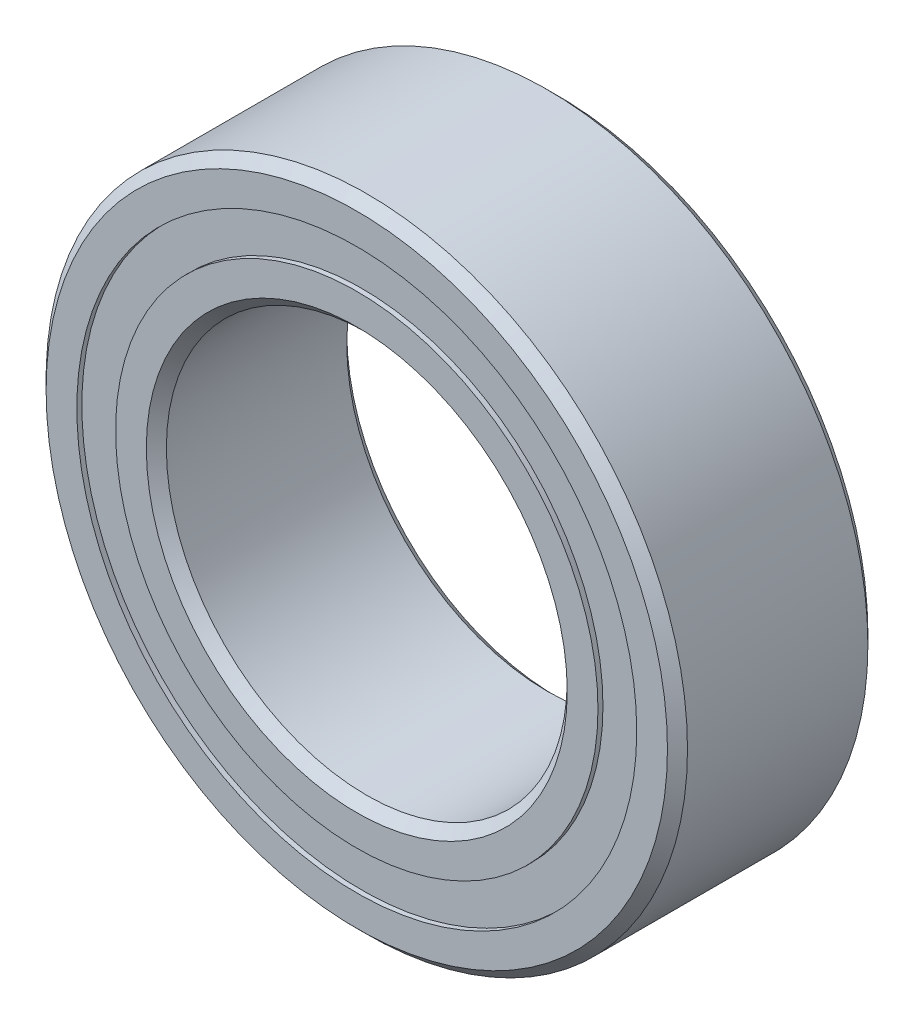
ISO-10303-21;
HEADER;
FILE_DESCRIPTION(('STEP AP214'),'2;1');
FILE_NAME('part.step','',(''),(''),'','','');
FILE_SCHEMA(('AUTOMOTIVE_DESIGN { 1 0 10303 214 1 1 1 1 }'));
ENDSEC;
DATA;
#1=APPLICATION_CONTEXT('core data for automotive mechanical design processes');
#2=APPLICATION_PROTOCOL_DEFINITION('international standard','automotive_design',2000,#1);
#3=PRODUCT_CONTEXT('',#1,'mechanical');
#4=PRODUCT('Part','Part','',(#3));
#5=PRODUCT_RELATED_PRODUCT_CATEGORY('part','',(#4));
#6=PRODUCT_DEFINITION_FORMATION('','',#4);
#7=PRODUCT_DEFINITION_CONTEXT('part definition',#1,'design');
#8=PRODUCT_DEFINITION('design','',#6,#7);
#9=PRODUCT_DEFINITION_SHAPE('','',#8);
#10=(LENGTH_UNIT() NAMED_UNIT(*) SI_UNIT(.MILLI.,.METRE.));
#11=(NAMED_UNIT(*) PLANE_ANGLE_UNIT() SI_UNIT($,.RADIAN.));
#12=(NAMED_UNIT(*) SI_UNIT($,.STERADIAN.) SOLID_ANGLE_UNIT());
#13=UNCERTAINTY_MEASURE_WITH_UNIT(LENGTH_MEASURE(1.E-05),#10,'distance_accuracy_value','');
#14=(GEOMETRIC_REPRESENTATION_CONTEXT(3) GLOBAL_UNCERTAINTY_ASSIGNED_CONTEXT((#13)) GLOBAL_UNIT_ASSIGNED_CONTEXT((#10,
#11,#12)) REPRESENTATION_CONTEXT('',''));
#15=CARTESIAN_POINT('',(0.,0.,0.));
#16=DIRECTION('',(0.,0.,1.));
#17=DIRECTION('',(1.,0.,0.));
#18=AXIS2_PLACEMENT_3D('',#15,#16,#17);
#19=CARTESIAN_POINT('',(0.,3.49175824175824,-1.1875));
#20=DIRECTION('',(0.,0.,1.));
#21=DIRECTION('',(1.,0.,0.));
#22=AXIS2_PLACEMENT_3D('',#19,#20,#21);
#23=PLANE('',#22);
#24=CARTESIAN_POINT('',(0.,0.,-1.1875));
#25=DIRECTION('',(0.,0.,1.));
#26=DIRECTION('',(1.,0.,0.));
#27=AXIS2_PLACEMENT_3D('',#24,#25,#26);
#28=CIRCLE('',#27,3.49175824175824);
#29=CARTESIAN_POINT('',(3.49175824175824,0.,-1.1875));
#30=VERTEX_POINT('',#29);
#31=EDGE_CURVE('E70',#30,#30,#28,.T.);
#32=ORIENTED_EDGE('',*,*,#31,.F.);
#33=EDGE_LOOP('',(#32));
#34=FACE_BOUND('',#33,.T.);
#35=CARTESIAN_POINT('',(0.,0.,-1.1875));
#36=DIRECTION('',(0.,0.,1.));
#37=DIRECTION('',(1.,0.,0.));
#38=AXIS2_PLACEMENT_3D('',#35,#36,#37);
#39=CIRCLE('',#38,3.00824175824176);
#40=CARTESIAN_POINT('',(3.00824175824176,0.,-1.1875));
#41=VERTEX_POINT('',#40);
#42=EDGE_CURVE('E11',#41,#41,#39,.T.);
#43=ORIENTED_EDGE('',*,*,#42,.T.);
#44=EDGE_LOOP('',(#43));
#45=FACE_BOUND('',#44,.T.);
#46=ADVANCED_FACE('F56',(#34,#45),#23,.F.);
#47=CARTESIAN_POINT('',(0.,0.,1.25));
#48=DIRECTION('',(0.,0.,1.));
#49=DIRECTION('',(1.,0.,0.));
#50=AXIS2_PLACEMENT_3D('',#47,#48,#49);
#51=CYLINDRICAL_SURFACE('',#50,3.00824175824176);
#52=ORIENTED_EDGE('',*,*,#42,.F.);
#53=EDGE_LOOP('',(#52));
#54=FACE_BOUND('',#53,.T.);
#55=CARTESIAN_POINT('',(0.,0.,-0.605878719519575));
#56=DIRECTION('',(0.,0.,1.));
#57=DIRECTION('',(1.,0.,0.));
#58=AXIS2_PLACEMENT_3D('',#55,#56,#57);
#59=CIRCLE('',#58,3.00824175824176);
#60=CARTESIAN_POINT('',(3.00824175824176,0.,-0.605878719519575));
#61=VERTEX_POINT('',#60);
#62=EDGE_CURVE('E62',#61,#61,#59,.T.);
#63=ORIENTED_EDGE('',*,*,#62,.T.);
#64=EDGE_LOOP('',(#63));
#65=FACE_BOUND('',#64,.T.);
#66=ADVANCED_FACE('F79',(#54,#65),#51,.F.);
#67=CARTESIAN_POINT('',(0.,3.49175824175824,-0.605878719519575));
#68=DIRECTION('',(0.,0.,-1.));
#69=DIRECTION('',(-1.,0.,0.));
#70=AXIS2_PLACEMENT_3D('',#67,#68,#69);
#71=PLANE('',#70);
#72=ORIENTED_EDGE('',*,*,#62,.F.);
#73=EDGE_LOOP('',(#72));
#74=FACE_BOUND('',#73,.T.);
#75=CARTESIAN_POINT('',(0.,0.,-0.605878719519575));
#76=DIRECTION('',(0.,0.,1.));
#77=DIRECTION('',(1.,0.,0.));
#78=AXIS2_PLACEMENT_3D('',#75,#76,#77);
#79=CIRCLE('',#78,3.49175824175824);
#80=CARTESIAN_POINT('',(3.49175824175824,0.,-0.605878719519575));
#81=VERTEX_POINT('',#80);
#82=EDGE_CURVE('E66',#81,#81,#79,.T.);
#83=ORIENTED_EDGE('',*,*,#82,.T.);
#84=EDGE_LOOP('',(#83));
#85=FACE_BOUND('',#84,.T.);
#86=ADVANCED_FACE('F83',(#74,#85),#71,.F.);
#87=CARTESIAN_POINT('',(0.,0.,1.25));
#88=DIRECTION('',(0.,0.,1.));
#89=DIRECTION('',(1.,0.,0.));
#90=AXIS2_PLACEMENT_3D('',#87,#88,#89);
#91=CYLINDRICAL_SURFACE('',#90,3.49175824175824);
#92=ORIENTED_EDGE('',*,*,#82,.F.);
#93=EDGE_LOOP('',(#92));
#94=FACE_BOUND('',#93,.T.);
#95=ORIENTED_EDGE('',*,*,#31,.T.);
#96=EDGE_LOOP('',(#95));
#97=FACE_BOUND('',#96,.T.);
#98=ADVANCED_FACE('F76',(#94,#97),#91,.T.);
#99=CLOSED_SHELL('',(#46,#66,#86,#98));
#100=MANIFOLD_SOLID_BREP('B2',#99);
#101=CARTESIAN_POINT('',(0.,3.49175824175824,1.1875));
#102=DIRECTION('',(0.,0.,-1.));
#103=DIRECTION('',(-1.,0.,0.));
#104=AXIS2_PLACEMENT_3D('',#101,#102,#103);
#105=PLANE('',#104);
#106=CARTESIAN_POINT('',(0.,0.,1.1875));
#107=DIRECTION('',(0.,0.,1.));
#108=DIRECTION('',(1.,0.,0.));
#109=AXIS2_PLACEMENT_3D('',#106,#107,#108);
#110=CIRCLE('',#109,3.00824175824176);
#111=CARTESIAN_POINT('',(3.00824175824176,0.,1.1875));
#112=VERTEX_POINT('',#111);
#113=EDGE_CURVE('E55',#112,#112,#110,.T.);
#114=ORIENTED_EDGE('',*,*,#113,.F.);
#115=EDGE_LOOP('',(#114));
#116=FACE_BOUND('',#115,.T.);
#117=CARTESIAN_POINT('',(0.,0.,1.1875));
#118=DIRECTION('',(0.,0.,1.));
#119=DIRECTION('',(1.,0.,0.));
#120=AXIS2_PLACEMENT_3D('',#117,#118,#119);
#121=CIRCLE('',#120,3.49175824175824);
#122=CARTESIAN_POINT('',(3.49175824175824,0.,1.1875));
#123=VERTEX_POINT('',#122);
#124=EDGE_CURVE('E130',#123,#123,#121,.T.);
#125=ORIENTED_EDGE('',*,*,#124,.T.);
#126=EDGE_LOOP('',(#125));
#127=FACE_BOUND('',#126,.T.);
#128=ADVANCED_FACE('F116',(#116,#127),#105,.F.);
#129=CARTESIAN_POINT('',(0.,0.,1.25));
#130=DIRECTION('',(0.,0.,1.));
#131=DIRECTION('',(1.,0.,0.));
#132=AXIS2_PLACEMENT_3D('',#129,#130,#131);
#133=CYLINDRICAL_SURFACE('',#132,3.00824175824176);
#134=CARTESIAN_POINT('',(0.,0.,0.605878719519573));
#135=DIRECTION('',(0.,0.,1.));
#136=DIRECTION('',(1.,0.,0.));
#137=AXIS2_PLACEMENT_3D('',#134,#135,#136);
#138=CIRCLE('',#137,3.00824175824176);
#139=CARTESIAN_POINT('',(3.00824175824176,0.,0.605878719519573));
#140=VERTEX_POINT('',#139);
#141=EDGE_CURVE('E122',#140,#140,#138,.T.);
#142=ORIENTED_EDGE('',*,*,#141,.F.);
#143=EDGE_LOOP('',(#142));
#144=FACE_BOUND('',#143,.T.);
#145=ORIENTED_EDGE('',*,*,#113,.T.);
#146=EDGE_LOOP('',(#145));
#147=FACE_BOUND('',#146,.T.);
#148=ADVANCED_FACE('F145',(#144,#147),#133,.F.);
#149=CARTESIAN_POINT('',(0.,3.49175824175824,0.605878719519573));
#150=DIRECTION('',(0.,0.,1.));
#151=DIRECTION('',(1.,0.,0.));
#152=AXIS2_PLACEMENT_3D('',#149,#150,#151);
#153=PLANE('',#152);
#154=CARTESIAN_POINT('',(0.,0.,0.605878719519573));
#155=DIRECTION('',(0.,0.,1.));
#156=DIRECTION('',(1.,0.,0.));
#157=AXIS2_PLACEMENT_3D('',#154,#155,#156);
#158=CIRCLE('',#157,3.49175824175824);
#159=CARTESIAN_POINT('',(3.49175824175824,0.,0.605878719519573));
#160=VERTEX_POINT('',#159);
#161=EDGE_CURVE('E126',#160,#160,#158,.T.);
#162=ORIENTED_EDGE('',*,*,#161,.F.);
#163=EDGE_LOOP('',(#162));
#164=FACE_BOUND('',#163,.T.);
#165=ORIENTED_EDGE('',*,*,#141,.T.);
#166=EDGE_LOOP('',(#165));
#167=FACE_BOUND('',#166,.T.);
#168=ADVANCED_FACE('F140',(#164,#167),#153,.F.);
#169=CARTESIAN_POINT('',(0.,0.,1.25));
#170=DIRECTION('',(0.,0.,1.));
#171=DIRECTION('',(1.,0.,0.));
#172=AXIS2_PLACEMENT_3D('',#169,#170,#171);
#173=CYLINDRICAL_SURFACE('',#172,3.49175824175824);
#174=ORIENTED_EDGE('',*,*,#124,.F.);
#175=EDGE_LOOP('',(#174));
#176=FACE_BOUND('',#175,.T.);
#177=ORIENTED_EDGE('',*,*,#161,.T.);
#178=EDGE_LOOP('',(#177));
#179=FACE_BOUND('',#178,.T.);
#180=ADVANCED_FACE('F137',(#176,#179),#173,.T.);
#181=CLOSED_SHELL('',(#128,#148,#168,#180));
#182=MANIFOLD_SOLID_BREP('B6',#181);
#183=CARTESIAN_POINT('',(-1.62499999999996,2.81458256229945,0.));
#184=DIRECTION('',(0.,0.,1.));
#185=DIRECTION('',(-0.499999999999989,0.866025403784445,0.));
#186=AXIS2_PLACEMENT_3D('',#183,#184,#185);
#187=SPHERICAL_SURFACE('',#186,0.605878719519574);
#188=CARTESIAN_POINT('',(-1.62499999999996,2.81458256229945,0.605878719519573));
#189=VERTEX_POINT('',#188);
#190=VERTEX_LOOP('',#189);
#191=FACE_BOUND('',#190,.T.);
#192=ADVANCED_FACE('F176',(#191),#187,.T.);
#193=CLOSED_SHELL('',(#192));
#194=MANIFOLD_SOLID_BREP('B50',#193);
#195=CARTESIAN_POINT('',(-2.81458256229941,1.62500000000003,0.));
#196=DIRECTION('',(0.,0.,1.));
#197=DIRECTION('',(-0.866025403784433,0.50000000000001,0.));
#198=AXIS2_PLACEMENT_3D('',#195,#196,#197);
#199=SPHERICAL_SURFACE('',#198,0.605878719519574);
#200=CARTESIAN_POINT('',(-2.81458256229941,1.62500000000003,0.605878719519573));
#201=VERTEX_POINT('',#200);
#202=VERTEX_LOOP('',#201);
#203=FACE_BOUND('',#202,.T.);
#204=ADVANCED_FACE('F199',(#203),#199,.T.);
#205=CLOSED_SHELL('',(#204));
#206=MANIFOLD_SOLID_BREP('B112',#205);
#207=CARTESIAN_POINT('',(-3.25,0.,0.));
#208=DIRECTION('',(0.,0.,1.));
#209=DIRECTION('',(-1.,0.,0.));
#210=AXIS2_PLACEMENT_3D('',#207,#208,#209);
#211=SPHERICAL_SURFACE('',#210,0.605878719519574);
#212=CARTESIAN_POINT('',(-3.25,0.,0.605878719519573));
#213=VERTEX_POINT('',#212);
#214=VERTEX_LOOP('',#213);
#215=FACE_BOUND('',#214,.T.);
#216=ADVANCED_FACE('F222',(#215),#211,.T.);
#217=CLOSED_SHELL('',(#216));
#218=MANIFOLD_SOLID_BREP('B172',#217);
#219=CARTESIAN_POINT('',(-2.81458256229944,-1.62499999999997,0.));
#220=DIRECTION('',(0.,0.,1.));
#221=DIRECTION('',(-0.866025403784443,-0.499999999999992,0.));
#222=AXIS2_PLACEMENT_3D('',#219,#220,#221);
#223=SPHERICAL_SURFACE('',#222,0.605878719519574);
#224=CARTESIAN_POINT('',(-2.81458256229944,-1.62499999999997,0.605878719519573));
#225=VERTEX_POINT('',#224);
#226=VERTEX_LOOP('',#225);
#227=FACE_BOUND('',#226,.T.);
#228=ADVANCED_FACE('F245',(#227),#223,.T.);
#229=CLOSED_SHELL('',(#228));
#230=MANIFOLD_SOLID_BREP('B195',#229);
#231=CARTESIAN_POINT('',(-1.62500000000002,-2.81458256229941,0.));
#232=DIRECTION('',(0.,0.,1.));
#233=DIRECTION('',(-0.500000000000007,-0.866025403784435,0.));
#234=AXIS2_PLACEMENT_3D('',#231,#232,#233);
#235=SPHERICAL_SURFACE('',#234,0.605878719519574);
#236=CARTESIAN_POINT('',(-1.62500000000002,-2.81458256229941,0.605878719519573));
#237=VERTEX_POINT('',#236);
#238=VERTEX_LOOP('',#237);
#239=FACE_BOUND('',#238,.T.);
#240=ADVANCED_FACE('F268',(#239),#235,.T.);
#241=CLOSED_SHELL('',(#240));
#242=MANIFOLD_SOLID_BREP('B218',#241);
#243=CARTESIAN_POINT('',(0.,-3.25,0.));
#244=DIRECTION('',(0.,0.,1.));
#245=DIRECTION('',(0.,-1.,0.));
#246=AXIS2_PLACEMENT_3D('',#243,#244,#245);
#247=SPHERICAL_SURFACE('',#246,0.605878719519574);
#248=CARTESIAN_POINT('',(0.,-3.25,0.605878719519573));
#249=VERTEX_POINT('',#248);
#250=VERTEX_LOOP('',#249);
#251=FACE_BOUND('',#250,.T.);
#252=ADVANCED_FACE('F291',(#251),#247,.T.);
#253=CLOSED_SHELL('',(#252));
#254=MANIFOLD_SOLID_BREP('B241',#253);
#255=CARTESIAN_POINT('',(1.62499999999998,-2.81458256229944,0.));
#256=DIRECTION('',(0.,0.,1.));
#257=DIRECTION('',(0.499999999999995,-0.866025403784442,0.));
#258=AXIS2_PLACEMENT_3D('',#255,#256,#257);
#259=SPHERICAL_SURFACE('',#258,0.605878719519574);
#260=CARTESIAN_POINT('',(1.62499999999998,-2.81458256229944,0.605878719519573));
#261=VERTEX_POINT('',#260);
#262=VERTEX_LOOP('',#261);
#263=FACE_BOUND('',#262,.T.);
#264=ADVANCED_FACE('F314',(#263),#259,.T.);
#265=CLOSED_SHELL('',(#264));
#266=MANIFOLD_SOLID_BREP('B264',#265);
#267=CARTESIAN_POINT('',(2.81458256229942,-1.62500000000001,0.));
#268=DIRECTION('',(0.,0.,1.));
#269=DIRECTION('',(0.866025403784436,-0.500000000000004,0.));
#270=AXIS2_PLACEMENT_3D('',#267,#268,#269);
#271=SPHERICAL_SURFACE('',#270,0.605878719519574);
#272=CARTESIAN_POINT('',(2.81458256229942,-1.62500000000001,0.605878719519573));
#273=VERTEX_POINT('',#272);
#274=VERTEX_LOOP('',#273);
#275=FACE_BOUND('',#274,.T.);
#276=ADVANCED_FACE('F337',(#275),#271,.T.);
#277=CLOSED_SHELL('',(#276));
#278=MANIFOLD_SOLID_BREP('B287',#277);
#279=CARTESIAN_POINT('',(3.25,0.,0.));
#280=DIRECTION('',(0.,0.,1.));
#281=DIRECTION('',(1.,0.,0.));
#282=AXIS2_PLACEMENT_3D('',#279,#280,#281);
#283=SPHERICAL_SURFACE('',#282,0.605878719519574);
#284=CARTESIAN_POINT('',(3.25,0.,0.605878719519573));
#285=VERTEX_POINT('',#284);
#286=VERTEX_LOOP('',#285);
#287=FACE_BOUND('',#286,.T.);
#288=ADVANCED_FACE('F360',(#287),#283,.T.);
#289=CLOSED_SHELL('',(#288));
#290=MANIFOLD_SOLID_BREP('B310',#289);
#291=CARTESIAN_POINT('',(2.81458256229943,1.62499999999999,0.));
#292=DIRECTION('',(0.,0.,1.));
#293=DIRECTION('',(0.86602540378444,0.499999999999998,0.));
#294=AXIS2_PLACEMENT_3D('',#291,#292,#293);
#295=SPHERICAL_SURFACE('',#294,0.605878719519574);
#296=CARTESIAN_POINT('',(2.81458256229943,1.62499999999999,0.605878719519573));
#297=VERTEX_POINT('',#296);
#298=VERTEX_LOOP('',#297);
#299=FACE_BOUND('',#298,.T.);
#300=ADVANCED_FACE('F383',(#299),#295,.T.);
#301=CLOSED_SHELL('',(#300));
#302=MANIFOLD_SOLID_BREP('B333',#301);
#303=CARTESIAN_POINT('',(1.625,2.81458256229942,0.));
#304=DIRECTION('',(0.,0.,1.));
#305=DIRECTION('',(0.500000000000001,0.866025403784438,0.));
#306=AXIS2_PLACEMENT_3D('',#303,#304,#305);
#307=SPHERICAL_SURFACE('',#306,0.605878719519574);
#308=CARTESIAN_POINT('',(1.625,2.81458256229942,0.605878719519573));
#309=VERTEX_POINT('',#308);
#310=VERTEX_LOOP('',#309);
#311=FACE_BOUND('',#310,.T.);
#312=ADVANCED_FACE('F406',(#311),#307,.T.);
#313=CLOSED_SHELL('',(#312));
#314=MANIFOLD_SOLID_BREP('B356',#313);
#315=CARTESIAN_POINT('',(0.,3.25,0.));
#316=DIRECTION('',(0.,0.,1.));
#317=DIRECTION('',(0.,1.,0.));
#318=AXIS2_PLACEMENT_3D('',#315,#316,#317);
#319=SPHERICAL_SURFACE('',#318,0.605878719519574);
#320=CARTESIAN_POINT('',(0.,3.25,0.605878719519573));
#321=VERTEX_POINT('',#320);
#322=VERTEX_LOOP('',#321);
#323=FACE_BOUND('',#322,.T.);
#324=ADVANCED_FACE('F431',(#323),#319,.T.);
#325=CLOSED_SHELL('',(#324));
#326=MANIFOLD_SOLID_BREP('B379',#325);
#327=CARTESIAN_POINT('',(0.,3.00824175824176,1.25));
#328=DIRECTION('',(0.,0.,-1.));
#329=DIRECTION('',(-1.,0.,0.));
#330=AXIS2_PLACEMENT_3D('',#327,#328,#329);
#331=PLANE('',#330);
#332=CARTESIAN_POINT('',(0.,0.,1.25));
#333=DIRECTION('',(0.,0.,1.));
#334=DIRECTION('',(1.,0.,0.));
#335=AXIS2_PLACEMENT_3D('',#332,#333,#334);
#336=CIRCLE('',#335,2.625);
#337=CARTESIAN_POINT('',(2.625,0.,1.25));
#338=VERTEX_POINT('',#337);
#339=EDGE_CURVE('E477',#338,#338,#336,.T.);
#340=ORIENTED_EDGE('',*,*,#339,.F.);
#341=EDGE_LOOP('',(#340));
#342=FACE_BOUND('',#341,.T.);
#343=CARTESIAN_POINT('',(0.,0.,1.25));
#344=DIRECTION('',(0.,0.,1.));
#345=DIRECTION('',(1.,0.,0.));
#346=AXIS2_PLACEMENT_3D('',#343,#344,#345);
#347=CIRCLE('',#346,3.00824175824176);
#348=CARTESIAN_POINT('',(3.00824175824176,0.,1.25));
#349=VERTEX_POINT('',#348);
#350=EDGE_CURVE('E430',#349,#349,#347,.T.);
#351=ORIENTED_EDGE('',*,*,#350,.T.);
#352=EDGE_LOOP('',(#351));
#353=FACE_BOUND('',#352,.T.);
#354=ADVANCED_FACE('F449',(#342,#353),#331,.F.);
#355=CARTESIAN_POINT('',(0.,0.,1.25));
#356=DIRECTION('',(0.,0.,1.));
#357=DIRECTION('',(1.,0.,0.));
#358=AXIS2_PLACEMENT_3D('',#355,#356,#357);
#359=CYLINDRICAL_SURFACE('',#358,3.00824175824176);
#360=ORIENTED_EDGE('',*,*,#350,.F.);
#361=EDGE_LOOP('',(#360));
#362=FACE_BOUND('',#361,.T.);
#363=CARTESIAN_POINT('',(0.,0.,0.555555555555555));
#364=DIRECTION('',(0.,0.,1.));
#365=DIRECTION('',(1.,0.,0.));
#366=AXIS2_PLACEMENT_3D('',#363,#364,#365);
#367=CIRCLE('',#366,3.00824175824176);
#368=CARTESIAN_POINT('',(3.00824175824176,0.,0.555555555555555));
#369=VERTEX_POINT('',#368);
#370=EDGE_CURVE('E455',#369,#369,#367,.T.);
#371=ORIENTED_EDGE('',*,*,#370,.T.);
#372=EDGE_LOOP('',(#371));
#373=FACE_BOUND('',#372,.T.);
#374=ADVANCED_FACE('F484',(#362,#373),#359,.T.);
#375=CARTESIAN_POINT('',(0.,0.,0.));
#376=DIRECTION('',(0.,0.,1.));
#377=DIRECTION('',(1.,0.,0.));
#378=AXIS2_PLACEMENT_3D('',#375,#376,#377);
#379=TOROIDAL_SURFACE('',#378,3.25,0.605878719519573);
#380=ORIENTED_EDGE('',*,*,#370,.F.);
#381=EDGE_LOOP('',(#380));
#382=FACE_BOUND('',#381,.T.);
#383=CARTESIAN_POINT('',(0.,0.,-0.555555555555557));
#384=DIRECTION('',(0.,0.,1.));
#385=DIRECTION('',(1.,0.,0.));
#386=AXIS2_PLACEMENT_3D('',#383,#384,#385);
#387=CIRCLE('',#386,3.00824175824176);
#388=CARTESIAN_POINT('',(3.00824175824176,0.,-0.555555555555557));
#389=VERTEX_POINT('',#388);
#390=EDGE_CURVE('E459',#389,#389,#387,.T.);
#391=ORIENTED_EDGE('',*,*,#390,.T.);
#392=EDGE_LOOP('',(#391));
#393=FACE_BOUND('',#392,.T.);
#394=ADVANCED_FACE('F488',(#382,#393),#379,.F.);
#395=CARTESIAN_POINT('',(0.,0.,1.25));
#396=DIRECTION('',(0.,0.,1.));
#397=DIRECTION('',(1.,0.,0.));
#398=AXIS2_PLACEMENT_3D('',#395,#396,#397);
#399=CYLINDRICAL_SURFACE('',#398,3.00824175824176);
#400=ORIENTED_EDGE('',*,*,#390,.F.);
#401=EDGE_LOOP('',(#400));
#402=FACE_BOUND('',#401,.T.);
#403=CARTESIAN_POINT('',(0.,0.,-1.25));
#404=DIRECTION('',(0.,0.,1.));
#405=DIRECTION('',(1.,0.,0.));
#406=AXIS2_PLACEMENT_3D('',#403,#404,#405);
#407=CIRCLE('',#406,3.00824175824176);
#408=CARTESIAN_POINT('',(3.00824175824176,0.,-1.25));
#409=VERTEX_POINT('',#408);
#410=EDGE_CURVE('E463',#409,#409,#407,.T.);
#411=ORIENTED_EDGE('',*,*,#410,.T.);
#412=EDGE_LOOP('',(#411));
#413=FACE_BOUND('',#412,.T.);
#414=ADVANCED_FACE('F493',(#402,#413),#399,.T.);
#415=CARTESIAN_POINT('',(0.,2.625,-1.25));
#416=DIRECTION('',(0.,0.,1.));
#417=DIRECTION('',(1.,0.,0.));
#418=AXIS2_PLACEMENT_3D('',#415,#416,#417);
#419=PLANE('',#418);
#420=ORIENTED_EDGE('',*,*,#410,.F.);
#421=EDGE_LOOP('',(#420));
#422=FACE_BOUND('',#421,.T.);
#423=CARTESIAN_POINT('',(0.,0.,-1.25));
#424=DIRECTION('',(0.,0.,1.));
#425=DIRECTION('',(1.,0.,0.));
#426=AXIS2_PLACEMENT_3D('',#423,#424,#425);
#427=CIRCLE('',#426,2.625);
#428=CARTESIAN_POINT('',(2.625,0.,-1.25));
#429=VERTEX_POINT('',#428);
#430=EDGE_CURVE('E468',#429,#429,#427,.T.);
#431=ORIENTED_EDGE('',*,*,#430,.T.);
#432=EDGE_LOOP('',(#431));
#433=FACE_BOUND('',#432,.T.);
#434=ADVANCED_FACE('F499',(#422,#433),#419,.F.);
#435=CARTESIAN_POINT('',(0.,0.,-1.125));
#436=DIRECTION('',(0.,0.,-1.));
#437=DIRECTION('',(-1.,0.,0.));
#438=AXIS2_PLACEMENT_3D('',#435,#436,#437);
#439=CONICAL_SURFACE('',#438,2.5,0.78539816339745);
#440=ORIENTED_EDGE('',*,*,#430,.F.);
#441=EDGE_LOOP('',(#440));
#442=FACE_BOUND('',#441,.T.);
#443=CARTESIAN_POINT('',(0.,0.,-1.125));
#444=DIRECTION('',(0.,0.,1.));
#445=DIRECTION('',(1.,0.,0.));
#446=AXIS2_PLACEMENT_3D('',#443,#444,#445);
#447=CIRCLE('',#446,2.5);
#448=CARTESIAN_POINT('',(2.5,0.,-1.125));
#449=VERTEX_POINT('',#448);
#450=EDGE_CURVE('E471',#449,#449,#447,.T.);
#451=ORIENTED_EDGE('',*,*,#450,.T.);
#452=EDGE_LOOP('',(#451));
#453=FACE_BOUND('',#452,.T.);
#454=ADVANCED_FACE('F503',(#442,#453),#439,.F.);
#455=CARTESIAN_POINT('',(0.,0.,1.25));
#456=DIRECTION('',(0.,0.,1.));
#457=DIRECTION('',(1.,0.,0.));
#458=AXIS2_PLACEMENT_3D('',#455,#456,#457);
#459=CYLINDRICAL_SURFACE('',#458,2.5);
#460=ORIENTED_EDGE('',*,*,#450,.F.);
#461=EDGE_LOOP('',(#460));
#462=FACE_BOUND('',#461,.T.);
#463=CARTESIAN_POINT('',(0.,0.,1.125));
#464=DIRECTION('',(0.,0.,1.));
#465=DIRECTION('',(1.,0.,0.));
#466=AXIS2_PLACEMENT_3D('',#463,#464,#465);
#467=CIRCLE('',#466,2.5);
#468=CARTESIAN_POINT('',(2.5,0.,1.125));
#469=VERTEX_POINT('',#468);
#470=EDGE_CURVE('E474',#469,#469,#467,.T.);
#471=ORIENTED_EDGE('',*,*,#470,.T.);
#472=EDGE_LOOP('',(#471));
#473=FACE_BOUND('',#472,.T.);
#474=ADVANCED_FACE('F507',(#462,#473),#459,.F.);
#475=CARTESIAN_POINT('',(0.,0.,1.25));
#476=DIRECTION('',(0.,0.,1.));
#477=DIRECTION('',(1.,0.,0.));
#478=AXIS2_PLACEMENT_3D('',#475,#476,#477);
#479=CONICAL_SURFACE('',#478,2.625,0.785398163397447);
#480=ORIENTED_EDGE('',*,*,#470,.F.);
#481=EDGE_LOOP('',(#480));
#482=FACE_BOUND('',#481,.T.);
#483=ORIENTED_EDGE('',*,*,#339,.T.);
#484=EDGE_LOOP('',(#483));
#485=FACE_BOUND('',#484,.T.);
#486=ADVANCED_FACE('F481',(#482,#485),#479,.F.);
#487=CLOSED_SHELL('',(#354,#374,#394,#414,#434,#454,#474,#486));
#488=MANIFOLD_SOLID_BREP('B402',#487);
#489=CARTESIAN_POINT('',(0.,0.,1.125));
#490=DIRECTION('',(0.,0.,-1.));
#491=DIRECTION('',(-1.,0.,0.));
#492=AXIS2_PLACEMENT_3D('',#489,#490,#491);
#493=CONICAL_SURFACE('',#492,4.,0.785398163397451);
#494=CARTESIAN_POINT('',(0.,0.,1.25));
#495=DIRECTION('',(0.,0.,1.));
#496=DIRECTION('',(1.,0.,0.));
#497=AXIS2_PLACEMENT_3D('',#494,#495,#496);
#498=CIRCLE('',#497,3.875);
#499=CARTESIAN_POINT('',(3.875,0.,1.25));
#500=VERTEX_POINT('',#499);
#501=EDGE_CURVE('E590',#500,#500,#498,.T.);
#502=ORIENTED_EDGE('',*,*,#501,.F.);
#503=EDGE_LOOP('',(#502));
#504=FACE_BOUND('',#503,.T.);
#505=CARTESIAN_POINT('',(0.,0.,1.125));
#506=DIRECTION('',(0.,0.,1.));
#507=DIRECTION('',(1.,0.,0.));
#508=AXIS2_PLACEMENT_3D('',#505,#506,#507);
#509=CIRCLE('',#508,4.);
#510=CARTESIAN_POINT('',(4.,0.,1.125));
#511=VERTEX_POINT('',#510);
#512=EDGE_CURVE('E448',#511,#511,#509,.T.);
#513=ORIENTED_EDGE('',*,*,#512,.T.);
#514=EDGE_LOOP('',(#513));
#515=FACE_BOUND('',#514,.T.);
#516=ADVANCED_FACE('F555',(#504,#515),#493,.T.);
#517=CARTESIAN_POINT('',(0.,0.,1.25));
#518=DIRECTION('',(0.,0.,1.));
#519=DIRECTION('',(1.,0.,0.));
#520=AXIS2_PLACEMENT_3D('',#517,#518,#519);
#521=CYLINDRICAL_SURFACE('',#520,4.);
#522=ORIENTED_EDGE('',*,*,#512,.F.);
#523=EDGE_LOOP('',(#522));
#524=FACE_BOUND('',#523,.T.);
#525=CARTESIAN_POINT('',(0.,0.,-1.125));
#526=DIRECTION('',(0.,0.,1.));
#527=DIRECTION('',(1.,0.,0.));
#528=AXIS2_PLACEMENT_3D('',#525,#526,#527);
#529=CIRCLE('',#528,4.);
#530=CARTESIAN_POINT('',(4.,0.,-1.125));
#531=VERTEX_POINT('',#530);
#532=EDGE_CURVE('E562',#531,#531,#529,.T.);
#533=ORIENTED_EDGE('',*,*,#532,.T.);
#534=EDGE_LOOP('',(#533));
#535=FACE_BOUND('',#534,.T.);
#536=ADVANCED_FACE('F598',(#524,#535),#521,.T.);
#537=CARTESIAN_POINT('',(0.,0.,-1.25));
#538=DIRECTION('',(0.,0.,1.));
#539=DIRECTION('',(1.,0.,0.));
#540=AXIS2_PLACEMENT_3D('',#537,#538,#539);
#541=CONICAL_SURFACE('',#540,3.875,0.78539816339745);
#542=ORIENTED_EDGE('',*,*,#532,.F.);
#543=EDGE_LOOP('',(#542));
#544=FACE_BOUND('',#543,.T.);
#545=CARTESIAN_POINT('',(0.,0.,-1.25));
#546=DIRECTION('',(0.,0.,1.));
#547=DIRECTION('',(1.,0.,0.));
#548=AXIS2_PLACEMENT_3D('',#545,#546,#547);
#549=CIRCLE('',#548,3.875);
#550=CARTESIAN_POINT('',(3.875,0.,-1.25));
#551=VERTEX_POINT('',#550);
#552=EDGE_CURVE('E567',#551,#551,#549,.T.);
#553=ORIENTED_EDGE('',*,*,#552,.T.);
#554=EDGE_LOOP('',(#553));
#555=FACE_BOUND('',#554,.T.);
#556=ADVANCED_FACE('F602',(#544,#555),#541,.T.);
#557=CARTESIAN_POINT('',(0.,3.875,-1.25));
#558=DIRECTION('',(0.,0.,1.));
#559=DIRECTION('',(1.,0.,0.));
#560=AXIS2_PLACEMENT_3D('',#557,#558,#559);
#561=PLANE('',#560);
#562=ORIENTED_EDGE('',*,*,#552,.F.);
#563=EDGE_LOOP('',(#562));
#564=FACE_BOUND('',#563,.T.);
#565=CARTESIAN_POINT('',(0.,0.,-1.25));
#566=DIRECTION('',(0.,0.,1.));
#567=DIRECTION('',(1.,0.,0.));
#568=AXIS2_PLACEMENT_3D('',#565,#566,#567);
#569=CIRCLE('',#568,3.49175824175824);
#570=CARTESIAN_POINT('',(3.49175824175824,0.,-1.25));
#571=VERTEX_POINT('',#570);
#572=EDGE_CURVE('E572',#571,#571,#569,.T.);
#573=ORIENTED_EDGE('',*,*,#572,.T.);
#574=EDGE_LOOP('',(#573));
#575=FACE_BOUND('',#574,.T.);
#576=ADVANCED_FACE('F607',(#564,#575),#561,.F.);
#577=CARTESIAN_POINT('',(0.,0.,1.25));
#578=DIRECTION('',(0.,0.,1.));
#579=DIRECTION('',(1.,0.,0.));
#580=AXIS2_PLACEMENT_3D('',#577,#578,#579);
#581=CYLINDRICAL_SURFACE('',#580,3.49175824175824);
#582=ORIENTED_EDGE('',*,*,#572,.F.);
#583=EDGE_LOOP('',(#582));
#584=FACE_BOUND('',#583,.T.);
#585=CARTESIAN_POINT('',(0.,0.,-0.555555555555556));
#586=DIRECTION('',(0.,0.,1.));
#587=DIRECTION('',(1.,0.,0.));
#588=AXIS2_PLACEMENT_3D('',#585,#586,#587);
#589=CIRCLE('',#588,3.49175824175824);
#590=CARTESIAN_POINT('',(3.49175824175824,0.,-0.555555555555556));
#591=VERTEX_POINT('',#590);
#592=EDGE_CURVE('E578',#591,#591,#589,.T.);
#593=ORIENTED_EDGE('',*,*,#592,.T.);
#594=EDGE_LOOP('',(#593));
#595=FACE_BOUND('',#594,.T.);
#596=ADVANCED_FACE('F613',(#584,#595),#581,.F.);
#597=CARTESIAN_POINT('',(0.,0.,0.));
#598=DIRECTION('',(0.,0.,1.));
#599=DIRECTION('',(1.,0.,0.));
#600=AXIS2_PLACEMENT_3D('',#597,#598,#599);
#601=TOROIDAL_SURFACE('',#600,3.25,0.605878719519574);
#602=ORIENTED_EDGE('',*,*,#592,.F.);
#603=EDGE_LOOP('',(#602));
#604=FACE_BOUND('',#603,.T.);
#605=CARTESIAN_POINT('',(0.,0.,0.555555555555555));
#606=DIRECTION('',(0.,0.,1.));
#607=DIRECTION('',(1.,0.,0.));
#608=AXIS2_PLACEMENT_3D('',#605,#606,#607);
#609=CIRCLE('',#608,3.49175824175824);
#610=CARTESIAN_POINT('',(3.49175824175824,0.,0.555555555555555));
#611=VERTEX_POINT('',#610);
#612=EDGE_CURVE('E582',#611,#611,#609,.T.);
#613=ORIENTED_EDGE('',*,*,#612,.T.);
#614=EDGE_LOOP('',(#613));
#615=FACE_BOUND('',#614,.T.);
#616=ADVANCED_FACE('F617',(#604,#615),#601,.F.);
#617=CARTESIAN_POINT('',(0.,0.,1.25));
#618=DIRECTION('',(0.,0.,1.));
#619=DIRECTION('',(1.,0.,0.));
#620=AXIS2_PLACEMENT_3D('',#617,#618,#619);
#621=CYLINDRICAL_SURFACE('',#620,3.49175824175824);
#622=ORIENTED_EDGE('',*,*,#612,.F.);
#623=EDGE_LOOP('',(#622));
#624=FACE_BOUND('',#623,.T.);
#625=CARTESIAN_POINT('',(0.,0.,1.25));
#626=DIRECTION('',(0.,0.,1.));
#627=DIRECTION('',(1.,0.,0.));
#628=AXIS2_PLACEMENT_3D('',#625,#626,#627);
#629=CIRCLE('',#628,3.49175824175824);
#630=CARTESIAN_POINT('',(3.49175824175824,0.,1.25));
#631=VERTEX_POINT('',#630);
#632=EDGE_CURVE('E586',#631,#631,#629,.T.);
#633=ORIENTED_EDGE('',*,*,#632,.T.);
#634=EDGE_LOOP('',(#633));
#635=FACE_BOUND('',#634,.T.);
#636=ADVANCED_FACE('F621',(#624,#635),#621,.F.);
#637=CARTESIAN_POINT('',(0.,3.875,1.25));
#638=DIRECTION('',(0.,0.,-1.));
#639=DIRECTION('',(-1.,0.,0.));
#640=AXIS2_PLACEMENT_3D('',#637,#638,#639);
#641=PLANE('',#640);
#642=ORIENTED_EDGE('',*,*,#632,.F.);
#643=EDGE_LOOP('',(#642));
#644=FACE_BOUND('',#643,.T.);
#645=ORIENTED_EDGE('',*,*,#501,.T.);
#646=EDGE_LOOP('',(#645));
#647=FACE_BOUND('',#646,.T.);
#648=ADVANCED_FACE('F595',(#644,#647),#641,.F.);
#649=CLOSED_SHELL('',(#516,#536,#556,#576,#596,#616,#636,#648));
#650=MANIFOLD_SOLID_BREP('B425',#649);
#651=ADVANCED_BREP_SHAPE_REPRESENTATION('',(#18,#100,#182,#194,#206,#218,#230,#242,#254,#266,
#278,#290,#302,#314,#326,#488,#650),#14);
#652=SHAPE_DEFINITION_REPRESENTATION(#9,#651);
ENDSEC;
END-ISO-10303-21;
